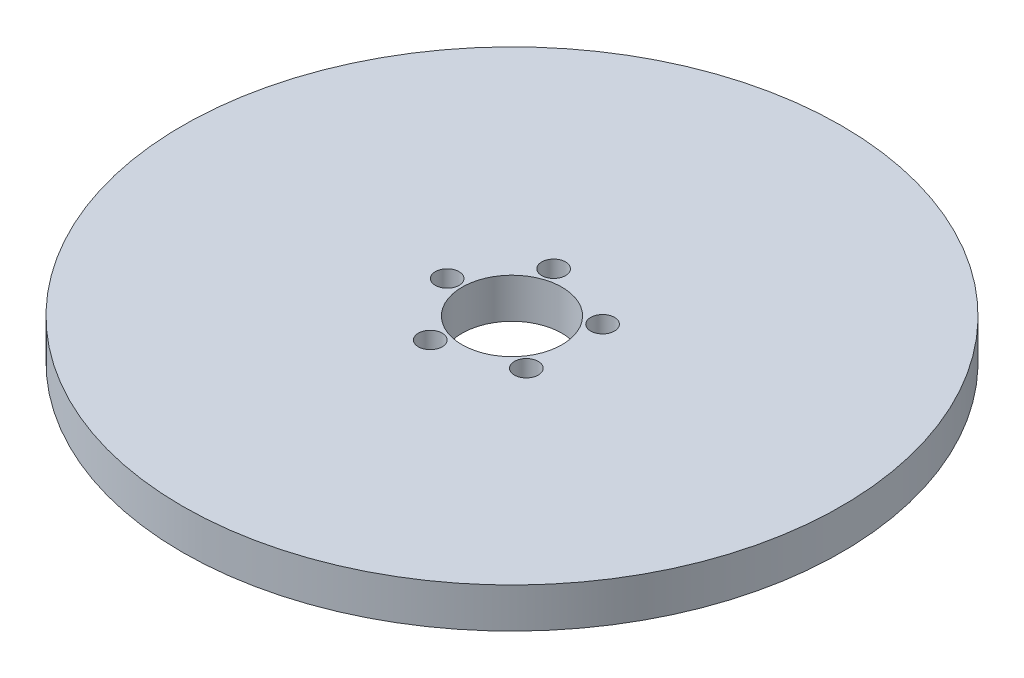
ISO-10303-21;
HEADER;
FILE_DESCRIPTION(('STEP AP214'),'2;1');
FILE_NAME('part.step','',(''),(''),'','','');
FILE_SCHEMA(('AUTOMOTIVE_DESIGN { 1 0 10303 214 1 1 1 1 }'));
ENDSEC;
DATA;
#1=APPLICATION_CONTEXT('core data for automotive mechanical design processes');
#2=APPLICATION_PROTOCOL_DEFINITION('international standard','automotive_design',2000,#1);
#3=PRODUCT_CONTEXT('',#1,'mechanical');
#4=PRODUCT('Part','Part','',(#3));
#5=PRODUCT_RELATED_PRODUCT_CATEGORY('part','',(#4));
#6=PRODUCT_DEFINITION_FORMATION('','',#4);
#7=PRODUCT_DEFINITION_CONTEXT('part definition',#1,'design');
#8=PRODUCT_DEFINITION('design','',#6,#7);
#9=PRODUCT_DEFINITION_SHAPE('','',#8);
#10=(LENGTH_UNIT() NAMED_UNIT(*) SI_UNIT(.MILLI.,.METRE.));
#11=(NAMED_UNIT(*) PLANE_ANGLE_UNIT() SI_UNIT($,.RADIAN.));
#12=(NAMED_UNIT(*) SI_UNIT($,.STERADIAN.) SOLID_ANGLE_UNIT());
#13=UNCERTAINTY_MEASURE_WITH_UNIT(LENGTH_MEASURE(1.E-05),#10,'distance_accuracy_value','');
#14=(GEOMETRIC_REPRESENTATION_CONTEXT(3) GLOBAL_UNCERTAINTY_ASSIGNED_CONTEXT((#13)) GLOBAL_UNIT_ASSIGNED_CONTEXT((#10,
#11,#12)) REPRESENTATION_CONTEXT('',''));
#15=CARTESIAN_POINT('',(0.,0.,0.));
#16=DIRECTION('',(0.,0.,1.));
#17=DIRECTION('',(1.,0.,0.));
#18=AXIS2_PLACEMENT_3D('',#15,#16,#17);
#19=CARTESIAN_POINT('',(0.,10.,0.));
#20=DIRECTION('',(0.,-1.,0.));
#21=DIRECTION('',(0.,0.,-1.));
#22=AXIS2_PLACEMENT_3D('',#19,#20,#21);
#23=CYLINDRICAL_SURFACE('',#22,82.5);
#24=CARTESIAN_POINT('',(0.,10.,0.));
#25=DIRECTION('',(0.,1.,0.));
#26=DIRECTION('',(0.,0.,1.));
#27=AXIS2_PLACEMENT_3D('',#24,#25,#26);
#28=CIRCLE('',#27,82.5);
#29=CARTESIAN_POINT('',(0.,10.,82.5));
#30=VERTEX_POINT('',#29);
#31=EDGE_CURVE('E10',#30,#30,#28,.T.);
#32=ORIENTED_EDGE('',*,*,#31,.F.);
#33=EDGE_LOOP('',(#32));
#34=FACE_BOUND('',#33,.T.);
#35=CARTESIAN_POINT('',(0.,0.,0.));
#36=DIRECTION('',(0.,1.,0.));
#37=DIRECTION('',(0.,0.,1.));
#38=AXIS2_PLACEMENT_3D('',#35,#36,#37);
#39=CIRCLE('',#38,82.5);
#40=CARTESIAN_POINT('',(0.,0.,82.5));
#41=VERTEX_POINT('',#40);
#42=EDGE_CURVE('E37',#41,#41,#39,.T.);
#43=ORIENTED_EDGE('',*,*,#42,.T.);
#44=EDGE_LOOP('',(#43));
#45=FACE_BOUND('',#44,.T.);
#46=ADVANCED_FACE('F40',(#34,#45),#23,.T.);
#47=CARTESIAN_POINT('',(0.,10.,0.));
#48=DIRECTION('',(0.,1.,0.));
#49=DIRECTION('',(0.,0.,1.));
#50=AXIS2_PLACEMENT_3D('',#47,#48,#49);
#51=PLANE('',#50);
#52=CARTESIAN_POINT('',(-5.01630794758588,10.,-15.4386083876859));
#53=DIRECTION('',(0.,1.,0.));
#54=DIRECTION('',(-0.95105651629515,0.,0.309016994374958));
#55=AXIS2_PLACEMENT_3D('',#52,#53,#54);
#56=CIRCLE('',#55,2.98142436763347);
#57=CARTESIAN_POINT('',(-7.85181102026484,10.,-14.5172975906435));
#58=VERTEX_POINT('',#57);
#59=EDGE_CURVE('E70',#58,#58,#56,.T.);
#60=ORIENTED_EDGE('',*,*,#59,.F.);
#61=EDGE_LOOP('',(#60));
#62=FACE_BOUND('',#61,.T.);
#63=CARTESIAN_POINT('',(13.1328647048155,10.,-9.54158472258922));
#64=DIRECTION('',(0.,1.,0.));
#65=DIRECTION('',(-0.58778525229248,0.,-0.809016994374942));
#66=AXIS2_PLACEMENT_3D('',#63,#64,#65);
#67=CIRCLE('',#66,2.98142436763347);
#68=CARTESIAN_POINT('',(11.3804274306951,10.,-11.9536077034483));
#69=VERTEX_POINT('',#68);
#70=EDGE_CURVE('E71',#69,#69,#67,.T.);
#71=ORIENTED_EDGE('',*,*,#70,.F.);
#72=EDGE_LOOP('',(#71));
#73=FACE_BOUND('',#72,.T.);
#74=CARTESIAN_POINT('',(13.1328647048157,10.,9.54158472258904));
#75=DIRECTION('',(0.,1.,0.));
#76=DIRECTION('',(0.587785252292469,0.,-0.809016994374951));
#77=AXIS2_PLACEMENT_3D('',#74,#75,#76);
#78=CIRCLE('',#77,2.98142436763347);
#79=CARTESIAN_POINT('',(14.885301978936,10.,7.12956174172997));
#80=VERTEX_POINT('',#79);
#81=EDGE_CURVE('E78',#80,#80,#78,.T.);
#82=ORIENTED_EDGE('',*,*,#81,.F.);
#83=EDGE_LOOP('',(#82));
#84=FACE_BOUND('',#83,.T.);
#85=CARTESIAN_POINT('',(-5.01630794758566,10.,15.4386083876859));
#86=DIRECTION('',(0.,1.,0.));
#87=DIRECTION('',(0.951056516295155,0.,0.309016994374945));
#88=AXIS2_PLACEMENT_3D('',#85,#86,#87);
#89=CIRCLE('',#88,2.98142436763347);
#90=CARTESIAN_POINT('',(-2.1808048749067,10.,16.3599191847282));
#91=VERTEX_POINT('',#90);
#92=EDGE_CURVE('E61',#91,#91,#89,.T.);
#93=ORIENTED_EDGE('',*,*,#92,.F.);
#94=EDGE_LOOP('',(#93));
#95=FACE_BOUND('',#94,.T.);
#96=CARTESIAN_POINT('',(-16.2331135144598,10.,0.));
#97=DIRECTION('',(0.,1.,0.));
#98=DIRECTION('',(0.,0.,1.));
#99=AXIS2_PLACEMENT_3D('',#96,#97,#98);
#100=CIRCLE('',#99,2.98142436763347);
#101=CARTESIAN_POINT('',(-16.2331135144598,10.,2.98142436763347));
#102=VERTEX_POINT('',#101);
#103=EDGE_CURVE('E54',#102,#102,#100,.T.);
#104=ORIENTED_EDGE('',*,*,#103,.F.);
#105=EDGE_LOOP('',(#104));
#106=FACE_BOUND('',#105,.T.);
#107=CARTESIAN_POINT('',(0.,10.,0.));
#108=DIRECTION('',(0.,1.,0.));
#109=DIRECTION('',(0.,0.,1.));
#110=AXIS2_PLACEMENT_3D('',#107,#108,#109);
#111=CIRCLE('',#110,12.5);
#112=CARTESIAN_POINT('',(0.,10.,12.5));
#113=VERTEX_POINT('',#112);
#114=EDGE_CURVE('E50',#113,#113,#111,.T.);
#115=ORIENTED_EDGE('',*,*,#114,.F.);
#116=EDGE_LOOP('',(#115));
#117=FACE_BOUND('',#116,.T.);
#118=ORIENTED_EDGE('',*,*,#31,.T.);
#119=EDGE_LOOP('',(#118));
#120=FACE_BOUND('',#119,.T.);
#121=ADVANCED_FACE('F94',(#62,#73,#84,#95,#106,#117,#120),#51,.T.);
#122=CARTESIAN_POINT('',(0.,0.,0.));
#123=DIRECTION('',(0.,1.,0.));
#124=DIRECTION('',(0.,0.,1.));
#125=AXIS2_PLACEMENT_3D('',#122,#123,#124);
#126=PLANE('',#125);
#127=CARTESIAN_POINT('',(0.,0.,0.));
#128=DIRECTION('',(0.,1.,0.));
#129=DIRECTION('',(0.,0.,1.));
#130=AXIS2_PLACEMENT_3D('',#127,#128,#129);
#131=CIRCLE('',#130,12.5);
#132=CARTESIAN_POINT('',(0.,0.,12.5));
#133=VERTEX_POINT('',#132);
#134=EDGE_CURVE('E47',#133,#133,#131,.T.);
#135=ORIENTED_EDGE('',*,*,#134,.T.);
#136=EDGE_LOOP('',(#135));
#137=FACE_BOUND('',#136,.T.);
#138=ORIENTED_EDGE('',*,*,#42,.F.);
#139=EDGE_LOOP('',(#138));
#140=FACE_BOUND('',#139,.T.);
#141=ADVANCED_FACE('F100',(#137,#140),#126,.F.);
#142=CARTESIAN_POINT('',(0.,10.,0.));
#143=DIRECTION('',(0.,-1.,0.));
#144=DIRECTION('',(0.,0.,-1.));
#145=AXIS2_PLACEMENT_3D('',#142,#143,#144);
#146=CYLINDRICAL_SURFACE('',#145,12.5);
#147=ORIENTED_EDGE('',*,*,#114,.T.);
#148=EDGE_LOOP('',(#147));
#149=FACE_BOUND('',#148,.T.);
#150=ORIENTED_EDGE('',*,*,#134,.F.);
#151=EDGE_LOOP('',(#150));
#152=FACE_BOUND('',#151,.T.);
#153=ADVANCED_FACE('F106',(#149,#152),#146,.F.);
#154=CARTESIAN_POINT('',(-16.2331135144598,0.949820258076809,0.));
#155=DIRECTION('',(0.,1.,0.));
#156=DIRECTION('',(0.,0.,1.));
#157=AXIS2_PLACEMENT_3D('',#154,#155,#156);
#158=CYLINDRICAL_SURFACE('',#157,2.98142436763347);
#159=CARTESIAN_POINT('',(-16.2331135144598,0.949820258076809,0.));
#160=DIRECTION('',(0.,1.,0.));
#161=DIRECTION('',(0.,0.,1.));
#162=AXIS2_PLACEMENT_3D('',#159,#160,#161);
#163=CIRCLE('',#162,2.98142436763347);
#164=CARTESIAN_POINT('',(-16.2331135144598,0.949820258076809,2.98142436763347));
#165=VERTEX_POINT('',#164);
#166=EDGE_CURVE('E55',#165,#165,#163,.T.);
#167=ORIENTED_EDGE('',*,*,#166,.F.);
#168=EDGE_LOOP('',(#167));
#169=FACE_BOUND('',#168,.T.);
#170=ORIENTED_EDGE('',*,*,#103,.T.);
#171=EDGE_LOOP('',(#170));
#172=FACE_BOUND('',#171,.T.);
#173=ADVANCED_FACE('F108',(#169,#172),#158,.F.);
#174=CARTESIAN_POINT('',(-16.2331135144598,0.949820258076809,0.));
#175=DIRECTION('',(0.,1.,0.));
#176=DIRECTION('',(0.,0.,1.));
#177=AXIS2_PLACEMENT_3D('',#174,#175,#176);
#178=PLANE('',#177);
#179=ORIENTED_EDGE('',*,*,#166,.T.);
#180=EDGE_LOOP('',(#179));
#181=FACE_BOUND('',#180,.T.);
#182=ADVANCED_FACE('F138',(#181),#178,.T.);
#183=CARTESIAN_POINT('',(-5.01630794758566,0.949820258076809,15.4386083876859));
#184=DIRECTION('',(0.,1.,0.));
#185=DIRECTION('',(0.,0.,1.));
#186=AXIS2_PLACEMENT_3D('',#183,#184,#185);
#187=CYLINDRICAL_SURFACE('',#186,2.98142436763347);
#188=CARTESIAN_POINT('',(-5.01630794758566,0.949820258076809,15.4386083876859));
#189=DIRECTION('',(0.,1.,0.));
#190=DIRECTION('',(0.951056516295155,0.,0.309016994374945));
#191=AXIS2_PLACEMENT_3D('',#188,#189,#190);
#192=CIRCLE('',#191,2.98142436763347);
#193=CARTESIAN_POINT('',(-2.1808048749067,0.949820258076809,16.3599191847282));
#194=VERTEX_POINT('',#193);
#195=EDGE_CURVE('E59',#194,#194,#192,.T.);
#196=ORIENTED_EDGE('',*,*,#195,.F.);
#197=EDGE_LOOP('',(#196));
#198=FACE_BOUND('',#197,.T.);
#199=ORIENTED_EDGE('',*,*,#92,.T.);
#200=EDGE_LOOP('',(#199));
#201=FACE_BOUND('',#200,.T.);
#202=ADVANCED_FACE('F150',(#198,#201),#187,.F.);
#203=CARTESIAN_POINT('',(-5.01630794758566,0.949820258076809,15.4386083876859));
#204=DIRECTION('',(0.,1.,0.));
#205=DIRECTION('',(0.951056516295155,0.,0.309016994374945));
#206=AXIS2_PLACEMENT_3D('',#203,#204,#205);
#207=PLANE('',#206);
#208=ORIENTED_EDGE('',*,*,#195,.T.);
#209=EDGE_LOOP('',(#208));
#210=FACE_BOUND('',#209,.T.);
#211=ADVANCED_FACE('F89',(#210),#207,.T.);
#212=CARTESIAN_POINT('',(13.1328647048157,0.949820258076809,9.54158472258904));
#213=DIRECTION('',(0.,1.,0.));
#214=DIRECTION('',(0.,0.,1.));
#215=AXIS2_PLACEMENT_3D('',#212,#213,#214);
#216=CYLINDRICAL_SURFACE('',#215,2.98142436763347);
#217=CARTESIAN_POINT('',(13.1328647048157,0.949820258076809,9.54158472258904));
#218=DIRECTION('',(0.,1.,0.));
#219=DIRECTION('',(0.587785252292469,0.,-0.809016994374951));
#220=AXIS2_PLACEMENT_3D('',#217,#218,#219);
#221=CIRCLE('',#220,2.98142436763347);
#222=CARTESIAN_POINT('',(14.885301978936,0.949820258076809,7.12956174172997));
#223=VERTEX_POINT('',#222);
#224=EDGE_CURVE('E63',#223,#223,#221,.T.);
#225=ORIENTED_EDGE('',*,*,#224,.F.);
#226=EDGE_LOOP('',(#225));
#227=FACE_BOUND('',#226,.T.);
#228=ORIENTED_EDGE('',*,*,#81,.T.);
#229=EDGE_LOOP('',(#228));
#230=FACE_BOUND('',#229,.T.);
#231=ADVANCED_FACE('F87',(#227,#230),#216,.F.);
#232=CARTESIAN_POINT('',(13.1328647048157,0.949820258076809,9.54158472258904));
#233=DIRECTION('',(0.,1.,0.));
#234=DIRECTION('',(0.587785252292469,0.,-0.809016994374951));
#235=AXIS2_PLACEMENT_3D('',#232,#233,#234);
#236=PLANE('',#235);
#237=ORIENTED_EDGE('',*,*,#224,.T.);
#238=EDGE_LOOP('',(#237));
#239=FACE_BOUND('',#238,.T.);
#240=ADVANCED_FACE('F84',(#239),#236,.T.);
#241=CARTESIAN_POINT('',(13.1328647048155,0.949820258076809,-9.54158472258922));
#242=DIRECTION('',(0.,1.,0.));
#243=DIRECTION('',(0.,0.,1.));
#244=AXIS2_PLACEMENT_3D('',#241,#242,#243);
#245=CYLINDRICAL_SURFACE('',#244,2.98142436763347);
#246=CARTESIAN_POINT('',(13.1328647048155,0.949820258076809,-9.54158472258922));
#247=DIRECTION('',(0.,1.,0.));
#248=DIRECTION('',(-0.58778525229248,0.,-0.809016994374942));
#249=AXIS2_PLACEMENT_3D('',#246,#247,#248);
#250=CIRCLE('',#249,2.98142436763347);
#251=CARTESIAN_POINT('',(11.3804274306951,0.949820258076809,-11.9536077034483));
#252=VERTEX_POINT('',#251);
#253=EDGE_CURVE('E76',#252,#252,#250,.T.);
#254=ORIENTED_EDGE('',*,*,#253,.F.);
#255=EDGE_LOOP('',(#254));
#256=FACE_BOUND('',#255,.T.);
#257=ORIENTED_EDGE('',*,*,#70,.T.);
#258=EDGE_LOOP('',(#257));
#259=FACE_BOUND('',#258,.T.);
#260=ADVANCED_FACE('F185',(#256,#259),#245,.F.);
#261=CARTESIAN_POINT('',(13.1328647048155,0.949820258076809,-9.54158472258922));
#262=DIRECTION('',(0.,1.,0.));
#263=DIRECTION('',(-0.58778525229248,0.,-0.809016994374942));
#264=AXIS2_PLACEMENT_3D('',#261,#262,#263);
#265=PLANE('',#264);
#266=ORIENTED_EDGE('',*,*,#253,.T.);
#267=EDGE_LOOP('',(#266));
#268=FACE_BOUND('',#267,.T.);
#269=ADVANCED_FACE('F189',(#268),#265,.T.);
#270=CARTESIAN_POINT('',(-5.01630794758588,0.949820258076809,-15.4386083876859));
#271=DIRECTION('',(0.,1.,0.));
#272=DIRECTION('',(0.,0.,1.));
#273=AXIS2_PLACEMENT_3D('',#270,#271,#272);
#274=CYLINDRICAL_SURFACE('',#273,2.98142436763347);
#275=CARTESIAN_POINT('',(-5.01630794758588,0.949820258076809,-15.4386083876859));
#276=DIRECTION('',(0.,1.,0.));
#277=DIRECTION('',(-0.95105651629515,0.,0.309016994374958));
#278=AXIS2_PLACEMENT_3D('',#275,#276,#277);
#279=CIRCLE('',#278,2.98142436763347);
#280=CARTESIAN_POINT('',(-7.85181102026484,0.949820258076809,-14.5172975906435));
#281=VERTEX_POINT('',#280);
#282=EDGE_CURVE('E69',#281,#281,#279,.T.);
#283=ORIENTED_EDGE('',*,*,#282,.F.);
#284=EDGE_LOOP('',(#283));
#285=FACE_BOUND('',#284,.T.);
#286=ORIENTED_EDGE('',*,*,#59,.T.);
#287=EDGE_LOOP('',(#286));
#288=FACE_BOUND('',#287,.T.);
#289=ADVANCED_FACE('F200',(#285,#288),#274,.F.);
#290=CARTESIAN_POINT('',(-5.01630794758588,0.949820258076809,-15.4386083876859));
#291=DIRECTION('',(0.,1.,0.));
#292=DIRECTION('',(-0.95105651629515,0.,0.309016994374958));
#293=AXIS2_PLACEMENT_3D('',#290,#291,#292);
#294=PLANE('',#293);
#295=ORIENTED_EDGE('',*,*,#282,.T.);
#296=EDGE_LOOP('',(#295));
#297=FACE_BOUND('',#296,.T.);
#298=ADVANCED_FACE('F208',(#297),#294,.T.);
#299=CLOSED_SHELL('',(#46,#121,#141,#153,#173,#182,#202,#211,#231,#240,#260,#269,#289,#298));
#300=MANIFOLD_SOLID_BREP('B2',#299);
#301=ADVANCED_BREP_SHAPE_REPRESENTATION('',(#18,#300),#14);
#302=SHAPE_DEFINITION_REPRESENTATION(#9,#301);
ENDSEC;
END-ISO-10303-21;
